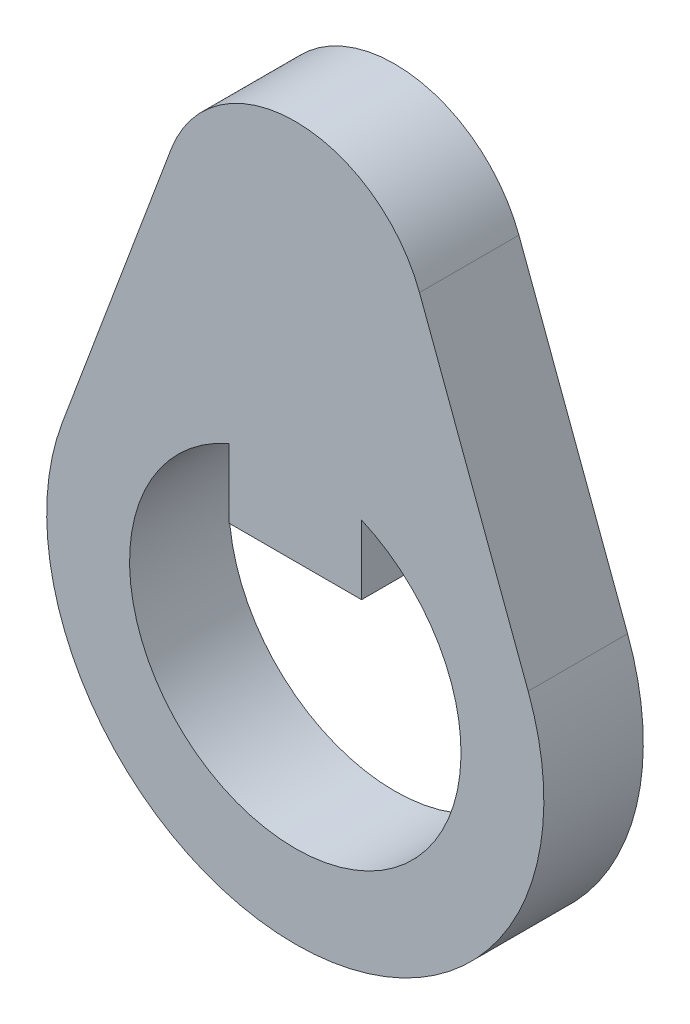
ISO-10303-21;
HEADER;
FILE_DESCRIPTION(('STEP AP214'),'2;1');
FILE_NAME('part.step','',(''),(''),'','','');
FILE_SCHEMA(('AUTOMOTIVE_DESIGN { 1 0 10303 214 1 1 1 1 }'));
ENDSEC;
DATA;
#1=APPLICATION_CONTEXT('core data for automotive mechanical design processes');
#2=APPLICATION_PROTOCOL_DEFINITION('international standard','automotive_design',2000,#1);
#3=PRODUCT_CONTEXT('',#1,'mechanical');
#4=PRODUCT('Part','Part','',(#3));
#5=PRODUCT_RELATED_PRODUCT_CATEGORY('part','',(#4));
#6=PRODUCT_DEFINITION_FORMATION('','',#4);
#7=PRODUCT_DEFINITION_CONTEXT('part definition',#1,'design');
#8=PRODUCT_DEFINITION('design','',#6,#7);
#9=PRODUCT_DEFINITION_SHAPE('','',#8);
#10=(LENGTH_UNIT() NAMED_UNIT(*) SI_UNIT(.MILLI.,.METRE.));
#11=(NAMED_UNIT(*) PLANE_ANGLE_UNIT() SI_UNIT($,.RADIAN.));
#12=(NAMED_UNIT(*) SI_UNIT($,.STERADIAN.) SOLID_ANGLE_UNIT());
#13=UNCERTAINTY_MEASURE_WITH_UNIT(LENGTH_MEASURE(1.E-05),#10,'distance_accuracy_value','');
#14=(GEOMETRIC_REPRESENTATION_CONTEXT(3) GLOBAL_UNCERTAINTY_ASSIGNED_CONTEXT((#13)) GLOBAL_UNIT_ASSIGNED_CONTEXT((#10,
#11,#12)) REPRESENTATION_CONTEXT('',''));
#15=CARTESIAN_POINT('',(0.,0.,0.));
#16=DIRECTION('',(0.,0.,1.));
#17=DIRECTION('',(1.,0.,0.));
#18=AXIS2_PLACEMENT_3D('',#15,#16,#17);
#19=CARTESIAN_POINT('',(-14.0512454963964,5.25,6.));
#20=DIRECTION('',(0.93674969975976,-0.35,0.));
#21=DIRECTION('',(0.35,0.93674969975976,0.));
#22=AXIS2_PLACEMENT_3D('',#19,#20,#21);
#23=PLANE('',#22);
#24=DIRECTION('',(-0.35,-0.93674969975976,0.));
#25=VECTOR('',#24,1.);
#26=CARTESIAN_POINT('',(-14.0512454963964,5.25,0.));
#27=LINE('',#26,#25);
#28=CARTESIAN_POINT('',(-7.49399759807808,22.8,0.));
#29=VERTEX_POINT('',#28);
#30=CARTESIAN_POINT('',(-14.0512454963964,5.25,0.));
#31=VERTEX_POINT('',#30);
#32=EDGE_CURVE('E142',#29,#31,#27,.T.);
#33=ORIENTED_EDGE('',*,*,#32,.T.);
#34=DIRECTION('',(0.,0.,-1.));
#35=VECTOR('',#34,1.);
#36=CARTESIAN_POINT('',(-14.0512454963964,5.25,6.));
#37=LINE('',#36,#35);
#38=CARTESIAN_POINT('',(-14.0512454963964,5.25,6.));
#39=VERTEX_POINT('',#38);
#40=EDGE_CURVE('E11',#39,#31,#37,.T.);
#41=ORIENTED_EDGE('',*,*,#40,.F.);
#42=DIRECTION('',(-0.35,-0.93674969975976,0.));
#43=VECTOR('',#42,1.);
#44=CARTESIAN_POINT('',(-14.0512454963964,5.25,6.));
#45=LINE('',#44,#43);
#46=CARTESIAN_POINT('',(-7.49399759807808,22.8,6.));
#47=VERTEX_POINT('',#46);
#48=EDGE_CURVE('E113',#47,#39,#45,.T.);
#49=ORIENTED_EDGE('',*,*,#48,.F.);
#50=DIRECTION('',(0.,0.,-1.));
#51=VECTOR('',#50,1.);
#52=CARTESIAN_POINT('',(-7.49399759807808,22.8,6.));
#53=LINE('',#52,#51);
#54=EDGE_CURVE('E53',#47,#29,#53,.T.);
#55=ORIENTED_EDGE('',*,*,#54,.T.);
#56=EDGE_LOOP('',(#33,#41,#49,#55));
#57=FACE_BOUND('',#56,.T.);
#58=ADVANCED_FACE('F34',(#57),#23,.F.);
#59=CARTESIAN_POINT('',(0.,0.,6.));
#60=DIRECTION('',(0.,0.,-1.));
#61=DIRECTION('',(-1.,0.,0.));
#62=AXIS2_PLACEMENT_3D('',#59,#60,#61);
#63=CYLINDRICAL_SURFACE('',#62,15.);
#64=CARTESIAN_POINT('',(0.,0.,0.));
#65=DIRECTION('',(0.,0.,1.));
#66=DIRECTION('',(1.,0.,0.));
#67=AXIS2_PLACEMENT_3D('',#64,#65,#66);
#68=CIRCLE('',#67,15.);
#69=CARTESIAN_POINT('',(14.0512454963964,5.25,0.));
#70=VERTEX_POINT('',#69);
#71=EDGE_CURVE('E119',#31,#70,#68,.T.);
#72=ORIENTED_EDGE('',*,*,#71,.T.);
#73=DIRECTION('',(0.,0.,-1.));
#74=VECTOR('',#73,1.);
#75=CARTESIAN_POINT('',(14.0512454963964,5.25,6.));
#76=LINE('',#75,#74);
#77=CARTESIAN_POINT('',(14.0512454963964,5.25,6.));
#78=VERTEX_POINT('',#77);
#79=EDGE_CURVE('E44',#78,#70,#76,.T.);
#80=ORIENTED_EDGE('',*,*,#79,.F.);
#81=CARTESIAN_POINT('',(0.,0.,6.));
#82=DIRECTION('',(0.,0.,1.));
#83=DIRECTION('',(1.,0.,0.));
#84=AXIS2_PLACEMENT_3D('',#81,#82,#83);
#85=CIRCLE('',#84,15.);
#86=EDGE_CURVE('E107',#39,#78,#85,.T.);
#87=ORIENTED_EDGE('',*,*,#86,.F.);
#88=ORIENTED_EDGE('',*,*,#40,.T.);
#89=EDGE_LOOP('',(#72,#80,#87,#88));
#90=FACE_BOUND('',#89,.T.);
#91=ADVANCED_FACE('F118',(#90),#63,.T.);
#92=CARTESIAN_POINT('',(14.0512454963964,5.25,6.));
#93=DIRECTION('',(0.93674969975976,0.35,0.));
#94=DIRECTION('',(-0.35,0.93674969975976,0.));
#95=AXIS2_PLACEMENT_3D('',#92,#93,#94);
#96=PLANE('',#95);
#97=DIRECTION('',(0.35,-0.93674969975976,0.));
#98=VECTOR('',#97,1.);
#99=CARTESIAN_POINT('',(14.0512454963964,5.25,0.));
#100=LINE('',#99,#98);
#101=CARTESIAN_POINT('',(7.49399759807808,22.8,0.));
#102=VERTEX_POINT('',#101);
#103=EDGE_CURVE('E145',#102,#70,#100,.T.);
#104=ORIENTED_EDGE('',*,*,#103,.F.);
#105=DIRECTION('',(0.,0.,-1.));
#106=VECTOR('',#105,1.);
#107=CARTESIAN_POINT('',(7.49399759807808,22.8,6.));
#108=LINE('',#107,#106);
#109=CARTESIAN_POINT('',(7.49399759807808,22.8,6.));
#110=VERTEX_POINT('',#109);
#111=EDGE_CURVE('E79',#110,#102,#108,.T.);
#112=ORIENTED_EDGE('',*,*,#111,.F.);
#113=DIRECTION('',(0.35,-0.93674969975976,0.));
#114=VECTOR('',#113,1.);
#115=CARTESIAN_POINT('',(14.0512454963964,5.25,6.));
#116=LINE('',#115,#114);
#117=EDGE_CURVE('E112',#110,#78,#116,.T.);
#118=ORIENTED_EDGE('',*,*,#117,.T.);
#119=ORIENTED_EDGE('',*,*,#79,.T.);
#120=EDGE_LOOP('',(#104,#112,#118,#119));
#121=FACE_BOUND('',#120,.T.);
#122=ADVANCED_FACE('F123',(#121),#96,.T.);
#123=CARTESIAN_POINT('',(0.,0.,6.));
#124=DIRECTION('',(0.,0.,-1.));
#125=DIRECTION('',(-1.,0.,0.));
#126=AXIS2_PLACEMENT_3D('',#123,#124,#125);
#127=CYLINDRICAL_SURFACE('',#126,10.);
#128=CARTESIAN_POINT('',(0.,0.,0.));
#129=DIRECTION('',(0.,0.,1.));
#130=DIRECTION('',(1.,0.,0.));
#131=AXIS2_PLACEMENT_3D('',#128,#129,#130);
#132=CIRCLE('',#131,10.);
#133=CARTESIAN_POINT('',(-4.,9.16515138991168,0.));
#134=VERTEX_POINT('',#133);
#135=CARTESIAN_POINT('',(4.,9.16515138991168,0.));
#136=VERTEX_POINT('',#135);
#137=EDGE_CURVE('E130',#134,#136,#132,.T.);
#138=ORIENTED_EDGE('',*,*,#137,.F.);
#139=DIRECTION('',(0.,0.,-1.));
#140=VECTOR('',#139,1.);
#141=CARTESIAN_POINT('',(-4.,9.16515138991168,6.));
#142=LINE('',#141,#140);
#143=CARTESIAN_POINT('',(-4.,9.16515138991168,6.));
#144=VERTEX_POINT('',#143);
#145=EDGE_CURVE('E38',#144,#134,#142,.T.);
#146=ORIENTED_EDGE('',*,*,#145,.F.);
#147=CARTESIAN_POINT('',(0.,0.,6.));
#148=DIRECTION('',(0.,0.,1.));
#149=DIRECTION('',(1.,0.,0.));
#150=AXIS2_PLACEMENT_3D('',#147,#148,#149);
#151=CIRCLE('',#150,10.);
#152=CARTESIAN_POINT('',(4.,9.16515138991168,6.));
#153=VERTEX_POINT('',#152);
#154=EDGE_CURVE('E150',#144,#153,#151,.T.);
#155=ORIENTED_EDGE('',*,*,#154,.T.);
#156=DIRECTION('',(0.,0.,-1.));
#157=VECTOR('',#156,1.);
#158=CARTESIAN_POINT('',(4.,9.16515138991168,6.));
#159=LINE('',#158,#157);
#160=EDGE_CURVE('E126',#153,#136,#159,.T.);
#161=ORIENTED_EDGE('',*,*,#160,.T.);
#162=EDGE_LOOP('',(#138,#146,#155,#161));
#163=FACE_BOUND('',#162,.T.);
#164=ADVANCED_FACE('F36',(#163),#127,.F.);
#165=CARTESIAN_POINT('',(-4.,0.,6.));
#166=DIRECTION('',(1.,0.,0.));
#167=DIRECTION('',(0.,1.,0.));
#168=AXIS2_PLACEMENT_3D('',#165,#166,#167);
#169=PLANE('',#168);
#170=DIRECTION('',(0.,-1.,0.));
#171=VECTOR('',#170,1.);
#172=CARTESIAN_POINT('',(-4.,0.,0.));
#173=LINE('',#172,#171);
#174=CARTESIAN_POINT('',(-4.,5.,0.));
#175=VERTEX_POINT('',#174);
#176=EDGE_CURVE('E133',#134,#175,#173,.T.);
#177=ORIENTED_EDGE('',*,*,#176,.T.);
#178=DIRECTION('',(0.,0.,-1.));
#179=VECTOR('',#178,1.);
#180=CARTESIAN_POINT('',(-4.,5.,6.));
#181=LINE('',#180,#179);
#182=CARTESIAN_POINT('',(-4.,5.,6.));
#183=VERTEX_POINT('',#182);
#184=EDGE_CURVE('E155',#183,#175,#181,.T.);
#185=ORIENTED_EDGE('',*,*,#184,.F.);
#186=DIRECTION('',(0.,-1.,0.));
#187=VECTOR('',#186,1.);
#188=CARTESIAN_POINT('',(-4.,0.,6.));
#189=LINE('',#188,#187);
#190=EDGE_CURVE('E163',#144,#183,#189,.T.);
#191=ORIENTED_EDGE('',*,*,#190,.F.);
#192=ORIENTED_EDGE('',*,*,#145,.T.);
#193=EDGE_LOOP('',(#177,#185,#191,#192));
#194=FACE_BOUND('',#193,.T.);
#195=ADVANCED_FACE('F162',(#194),#169,.F.);
#196=CARTESIAN_POINT('',(0.,5.,6.));
#197=DIRECTION('',(0.,-1.,0.));
#198=DIRECTION('',(1.,0.,0.));
#199=AXIS2_PLACEMENT_3D('',#196,#197,#198);
#200=PLANE('',#199);
#201=DIRECTION('',(-1.,0.,0.));
#202=VECTOR('',#201,1.);
#203=CARTESIAN_POINT('',(0.,5.,0.));
#204=LINE('',#203,#202);
#205=CARTESIAN_POINT('',(4.,5.,0.));
#206=VERTEX_POINT('',#205);
#207=EDGE_CURVE('E136',#206,#175,#204,.T.);
#208=ORIENTED_EDGE('',*,*,#207,.F.);
#209=DIRECTION('',(0.,0.,-1.));
#210=VECTOR('',#209,1.);
#211=CARTESIAN_POINT('',(4.,5.,6.));
#212=LINE('',#211,#210);
#213=CARTESIAN_POINT('',(4.,5.,6.));
#214=VERTEX_POINT('',#213);
#215=EDGE_CURVE('E154',#214,#206,#212,.T.);
#216=ORIENTED_EDGE('',*,*,#215,.F.);
#217=DIRECTION('',(-1.,0.,0.));
#218=VECTOR('',#217,1.);
#219=CARTESIAN_POINT('',(0.,5.,6.));
#220=LINE('',#219,#218);
#221=EDGE_CURVE('E202',#214,#183,#220,.T.);
#222=ORIENTED_EDGE('',*,*,#221,.T.);
#223=ORIENTED_EDGE('',*,*,#184,.T.);
#224=EDGE_LOOP('',(#208,#216,#222,#223));
#225=FACE_BOUND('',#224,.T.);
#226=ADVANCED_FACE('F175',(#225),#200,.T.);
#227=CARTESIAN_POINT('',(4.,0.,6.));
#228=DIRECTION('',(1.,0.,0.));
#229=DIRECTION('',(0.,0.,-1.));
#230=AXIS2_PLACEMENT_3D('',#227,#228,#229);
#231=PLANE('',#230);
#232=DIRECTION('',(0.,-1.,0.));
#233=VECTOR('',#232,1.);
#234=CARTESIAN_POINT('',(4.,0.,0.));
#235=LINE('',#234,#233);
#236=EDGE_CURVE('E139',#136,#206,#235,.T.);
#237=ORIENTED_EDGE('',*,*,#236,.F.);
#238=ORIENTED_EDGE('',*,*,#160,.F.);
#239=DIRECTION('',(0.,-1.,0.));
#240=VECTOR('',#239,1.);
#241=CARTESIAN_POINT('',(4.,0.,6.));
#242=LINE('',#241,#240);
#243=EDGE_CURVE('E173',#153,#214,#242,.T.);
#244=ORIENTED_EDGE('',*,*,#243,.T.);
#245=ORIENTED_EDGE('',*,*,#215,.T.);
#246=EDGE_LOOP('',(#237,#238,#244,#245));
#247=FACE_BOUND('',#246,.T.);
#248=ADVANCED_FACE('F172',(#247),#231,.T.);
#249=CARTESIAN_POINT('',(0.,20.,6.));
#250=DIRECTION('',(0.,0.,-1.));
#251=DIRECTION('',(-1.,0.,0.));
#252=AXIS2_PLACEMENT_3D('',#249,#250,#251);
#253=CYLINDRICAL_SURFACE('',#252,8.);
#254=CARTESIAN_POINT('',(0.,20.,0.));
#255=DIRECTION('',(0.,0.,1.));
#256=DIRECTION('',(1.,0.,0.));
#257=AXIS2_PLACEMENT_3D('',#254,#255,#256);
#258=CIRCLE('',#257,8.);
#259=EDGE_CURVE('E147',#29,#102,#258,.F.);
#260=ORIENTED_EDGE('',*,*,#259,.F.);
#261=ORIENTED_EDGE('',*,*,#54,.F.);
#262=CARTESIAN_POINT('',(0.,20.,6.));
#263=DIRECTION('',(0.,0.,1.));
#264=DIRECTION('',(1.,0.,0.));
#265=AXIS2_PLACEMENT_3D('',#262,#263,#264);
#266=CIRCLE('',#265,8.);
#267=EDGE_CURVE('E124',#47,#110,#266,.F.);
#268=ORIENTED_EDGE('',*,*,#267,.T.);
#269=ORIENTED_EDGE('',*,*,#111,.T.);
#270=EDGE_LOOP('',(#260,#261,#268,#269));
#271=FACE_BOUND('',#270,.T.);
#272=ADVANCED_FACE('F182',(#271),#253,.T.);
#273=CARTESIAN_POINT('',(0.,0.,6.));
#274=DIRECTION('',(0.,0.,1.));
#275=DIRECTION('',(1.,0.,0.));
#276=AXIS2_PLACEMENT_3D('',#273,#274,#275);
#277=PLANE('',#276);
#278=ORIENTED_EDGE('',*,*,#154,.F.);
#279=ORIENTED_EDGE('',*,*,#190,.T.);
#280=ORIENTED_EDGE('',*,*,#221,.F.);
#281=ORIENTED_EDGE('',*,*,#243,.F.);
#282=EDGE_LOOP('',(#278,#279,#280,#281));
#283=FACE_BOUND('',#282,.T.);
#284=ORIENTED_EDGE('',*,*,#48,.T.);
#285=ORIENTED_EDGE('',*,*,#86,.T.);
#286=ORIENTED_EDGE('',*,*,#117,.F.);
#287=ORIENTED_EDGE('',*,*,#267,.F.);
#288=EDGE_LOOP('',(#284,#285,#286,#287));
#289=FACE_BOUND('',#288,.T.);
#290=ADVANCED_FACE('F109',(#283,#289),#277,.T.);
#291=CARTESIAN_POINT('',(0.,0.,0.));
#292=DIRECTION('',(0.,0.,1.));
#293=DIRECTION('',(1.,0.,0.));
#294=AXIS2_PLACEMENT_3D('',#291,#292,#293);
#295=PLANE('',#294);
#296=ORIENTED_EDGE('',*,*,#137,.T.);
#297=ORIENTED_EDGE('',*,*,#236,.T.);
#298=ORIENTED_EDGE('',*,*,#207,.T.);
#299=ORIENTED_EDGE('',*,*,#176,.F.);
#300=EDGE_LOOP('',(#296,#297,#298,#299));
#301=FACE_BOUND('',#300,.T.);
#302=ORIENTED_EDGE('',*,*,#32,.F.);
#303=ORIENTED_EDGE('',*,*,#259,.T.);
#304=ORIENTED_EDGE('',*,*,#103,.T.);
#305=ORIENTED_EDGE('',*,*,#71,.F.);
#306=EDGE_LOOP('',(#302,#303,#304,#305));
#307=FACE_BOUND('',#306,.T.);
#308=ADVANCED_FACE('F166',(#301,#307),#295,.F.);
#309=CLOSED_SHELL('',(#58,#91,#122,#164,#195,#226,#248,#272,#290,#308));
#310=MANIFOLD_SOLID_BREP('B2',#309);
#311=ADVANCED_BREP_SHAPE_REPRESENTATION('',(#18,#310),#14);
#312=SHAPE_DEFINITION_REPRESENTATION(#9,#311);
ENDSEC;
END-ISO-10303-21;
